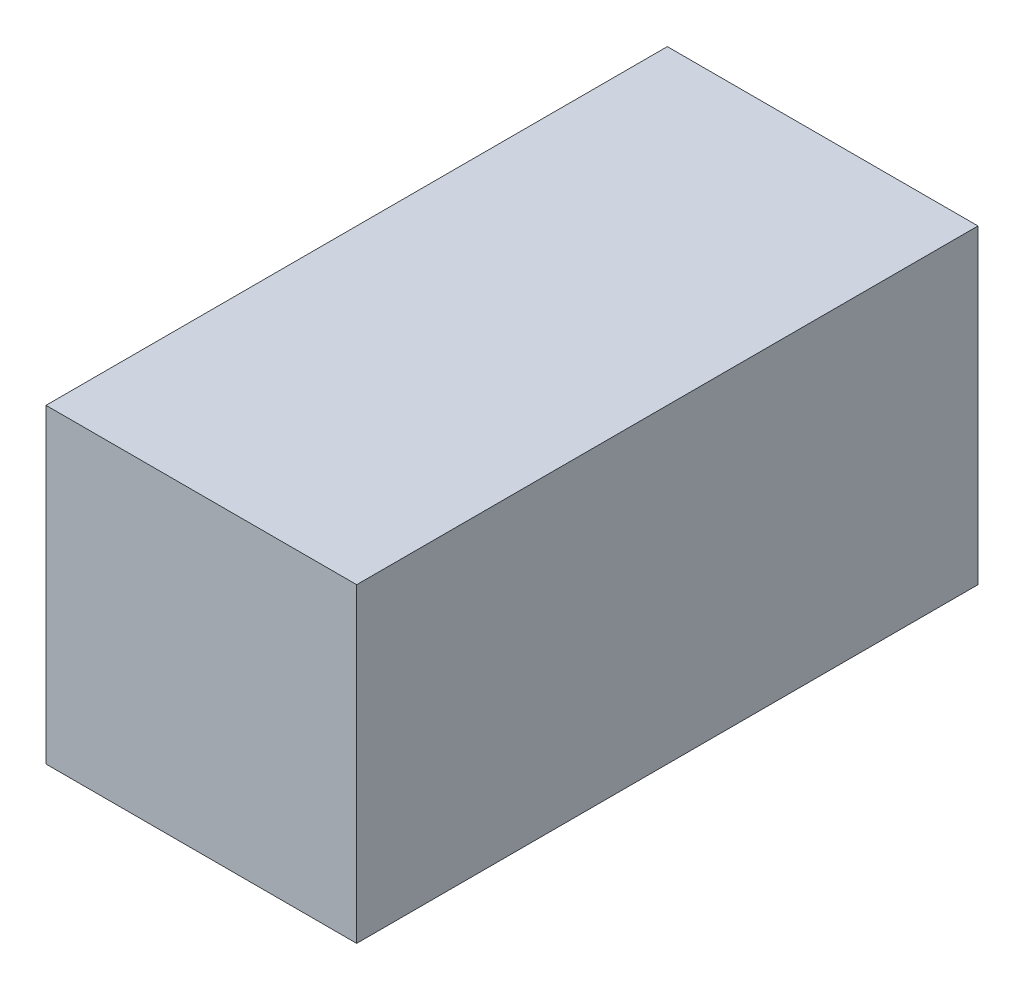
ISO-10303-21;
HEADER;
FILE_DESCRIPTION(('STEP AP214'),'2;1');
FILE_NAME('part.step','',(''),(''),'','','');
FILE_SCHEMA(('AUTOMOTIVE_DESIGN { 1 0 10303 214 1 1 1 1 }'));
ENDSEC;
DATA;
#1=APPLICATION_CONTEXT('core data for automotive mechanical design processes');
#2=APPLICATION_PROTOCOL_DEFINITION('international standard','automotive_design',2000,#1);
#3=PRODUCT_CONTEXT('',#1,'mechanical');
#4=PRODUCT('Part','Part','',(#3));
#5=PRODUCT_RELATED_PRODUCT_CATEGORY('part','',(#4));
#6=PRODUCT_DEFINITION_FORMATION('','',#4);
#7=PRODUCT_DEFINITION_CONTEXT('part definition',#1,'design');
#8=PRODUCT_DEFINITION('design','',#6,#7);
#9=PRODUCT_DEFINITION_SHAPE('','',#8);
#10=(LENGTH_UNIT() NAMED_UNIT(*) SI_UNIT(.MILLI.,.METRE.));
#11=(NAMED_UNIT(*) PLANE_ANGLE_UNIT() SI_UNIT($,.RADIAN.));
#12=(NAMED_UNIT(*) SI_UNIT($,.STERADIAN.) SOLID_ANGLE_UNIT());
#13=UNCERTAINTY_MEASURE_WITH_UNIT(LENGTH_MEASURE(1.E-05),#10,'distance_accuracy_value','');
#14=(GEOMETRIC_REPRESENTATION_CONTEXT(3) GLOBAL_UNCERTAINTY_ASSIGNED_CONTEXT((#13)) GLOBAL_UNIT_ASSIGNED_CONTEXT((#10,
#11,#12)) REPRESENTATION_CONTEXT('',''));
#15=CARTESIAN_POINT('',(0.,0.,0.));
#16=DIRECTION('',(0.,0.,1.));
#17=DIRECTION('',(1.,0.,0.));
#18=AXIS2_PLACEMENT_3D('',#15,#16,#17);
#19=CARTESIAN_POINT('',(0.,0.,20.));
#20=DIRECTION('',(-1.,0.,0.));
#21=DIRECTION('',(0.,0.,1.));
#22=AXIS2_PLACEMENT_3D('',#19,#20,#21);
#23=PLANE('',#22);
#24=DIRECTION('',(0.,1.,0.));
#25=VECTOR('',#24,1.);
#26=CARTESIAN_POINT('',(0.,0.,0.));
#27=LINE('',#26,#25);
#28=CARTESIAN_POINT('',(0.,0.,0.));
#29=VERTEX_POINT('',#28);
#30=CARTESIAN_POINT('',(0.,10.,0.));
#31=VERTEX_POINT('',#30);
#32=EDGE_CURVE('E98',#29,#31,#27,.T.);
#33=ORIENTED_EDGE('',*,*,#32,.T.);
#34=DIRECTION('',(0.,0.,-1.));
#35=VECTOR('',#34,1.);
#36=CARTESIAN_POINT('',(0.,10.,20.));
#37=LINE('',#36,#35);
#38=CARTESIAN_POINT('',(0.,10.,20.));
#39=VERTEX_POINT('',#38);
#40=EDGE_CURVE('E11',#39,#31,#37,.T.);
#41=ORIENTED_EDGE('',*,*,#40,.F.);
#42=DIRECTION('',(0.,1.,0.));
#43=VECTOR('',#42,1.);
#44=CARTESIAN_POINT('',(0.,0.,20.));
#45=LINE('',#44,#43);
#46=CARTESIAN_POINT('',(0.,0.,20.));
#47=VERTEX_POINT('',#46);
#48=EDGE_CURVE('E86',#47,#39,#45,.T.);
#49=ORIENTED_EDGE('',*,*,#48,.F.);
#50=DIRECTION('',(0.,0.,-1.));
#51=VECTOR('',#50,1.);
#52=CARTESIAN_POINT('',(0.,0.,20.));
#53=LINE('',#52,#51);
#54=EDGE_CURVE('E94',#47,#29,#53,.T.);
#55=ORIENTED_EDGE('',*,*,#54,.T.);
#56=EDGE_LOOP('',(#33,#41,#49,#55));
#57=FACE_BOUND('',#56,.T.);
#58=ADVANCED_FACE('F35',(#57),#23,.F.);
#59=CARTESIAN_POINT('',(0.,10.,20.));
#60=DIRECTION('',(0.,-1.,0.));
#61=DIRECTION('',(0.,0.,-1.));
#62=AXIS2_PLACEMENT_3D('',#59,#60,#61);
#63=PLANE('',#62);
#64=DIRECTION('',(-1.,0.,0.));
#65=VECTOR('',#64,1.);
#66=CARTESIAN_POINT('',(0.,10.,0.));
#67=LINE('',#66,#65);
#68=CARTESIAN_POINT('',(-10.,10.,0.));
#69=VERTEX_POINT('',#68);
#70=EDGE_CURVE('E90',#31,#69,#67,.T.);
#71=ORIENTED_EDGE('',*,*,#70,.T.);
#72=DIRECTION('',(0.,0.,-1.));
#73=VECTOR('',#72,1.);
#74=CARTESIAN_POINT('',(-10.,10.,20.));
#75=LINE('',#74,#73);
#76=CARTESIAN_POINT('',(-10.,10.,20.));
#77=VERTEX_POINT('',#76);
#78=EDGE_CURVE('E43',#77,#69,#75,.T.);
#79=ORIENTED_EDGE('',*,*,#78,.F.);
#80=DIRECTION('',(-1.,0.,0.));
#81=VECTOR('',#80,1.);
#82=CARTESIAN_POINT('',(0.,10.,20.));
#83=LINE('',#82,#81);
#84=EDGE_CURVE('E81',#39,#77,#83,.T.);
#85=ORIENTED_EDGE('',*,*,#84,.F.);
#86=ORIENTED_EDGE('',*,*,#40,.T.);
#87=EDGE_LOOP('',(#71,#79,#85,#86));
#88=FACE_BOUND('',#87,.T.);
#89=ADVANCED_FACE('F89',(#88),#63,.F.);
#90=CARTESIAN_POINT('',(-10.,0.,20.));
#91=DIRECTION('',(1.,0.,0.));
#92=DIRECTION('',(0.,0.,-1.));
#93=AXIS2_PLACEMENT_3D('',#90,#91,#92);
#94=PLANE('',#93);
#95=DIRECTION('',(0.,-1.,0.));
#96=VECTOR('',#95,1.);
#97=CARTESIAN_POINT('',(-10.,0.,0.));
#98=LINE('',#97,#96);
#99=CARTESIAN_POINT('',(-10.,0.,0.));
#100=VERTEX_POINT('',#99);
#101=EDGE_CURVE('E68',#69,#100,#98,.T.);
#102=ORIENTED_EDGE('',*,*,#101,.T.);
#103=DIRECTION('',(0.,0.,-1.));
#104=VECTOR('',#103,1.);
#105=CARTESIAN_POINT('',(-10.,0.,20.));
#106=LINE('',#105,#104);
#107=CARTESIAN_POINT('',(-10.,0.,20.));
#108=VERTEX_POINT('',#107);
#109=EDGE_CURVE('E91',#108,#100,#106,.T.);
#110=ORIENTED_EDGE('',*,*,#109,.F.);
#111=DIRECTION('',(0.,-1.,0.));
#112=VECTOR('',#111,1.);
#113=CARTESIAN_POINT('',(-10.,0.,20.));
#114=LINE('',#113,#112);
#115=EDGE_CURVE('E84',#77,#108,#114,.T.);
#116=ORIENTED_EDGE('',*,*,#115,.F.);
#117=ORIENTED_EDGE('',*,*,#78,.T.);
#118=EDGE_LOOP('',(#102,#110,#116,#117));
#119=FACE_BOUND('',#118,.T.);
#120=ADVANCED_FACE('F92',(#119),#94,.F.);
#121=CARTESIAN_POINT('',(0.,0.,20.));
#122=DIRECTION('',(0.,1.,0.));
#123=DIRECTION('',(0.,0.,1.));
#124=AXIS2_PLACEMENT_3D('',#121,#122,#123);
#125=PLANE('',#124);
#126=DIRECTION('',(1.,0.,0.));
#127=VECTOR('',#126,1.);
#128=CARTESIAN_POINT('',(0.,0.,0.));
#129=LINE('',#128,#127);
#130=EDGE_CURVE('E74',#100,#29,#129,.T.);
#131=ORIENTED_EDGE('',*,*,#130,.T.);
#132=ORIENTED_EDGE('',*,*,#54,.F.);
#133=DIRECTION('',(1.,0.,0.));
#134=VECTOR('',#133,1.);
#135=CARTESIAN_POINT('',(0.,0.,20.));
#136=LINE('',#135,#134);
#137=EDGE_CURVE('E51',#108,#47,#136,.T.);
#138=ORIENTED_EDGE('',*,*,#137,.F.);
#139=ORIENTED_EDGE('',*,*,#109,.T.);
#140=EDGE_LOOP('',(#131,#132,#138,#139));
#141=FACE_BOUND('',#140,.T.);
#142=ADVANCED_FACE('F105',(#141),#125,.F.);
#143=CARTESIAN_POINT('',(0.,0.,20.));
#144=DIRECTION('',(0.,0.,1.));
#145=DIRECTION('',(1.,0.,0.));
#146=AXIS2_PLACEMENT_3D('',#143,#144,#145);
#147=PLANE('',#146);
#148=ORIENTED_EDGE('',*,*,#48,.T.);
#149=ORIENTED_EDGE('',*,*,#84,.T.);
#150=ORIENTED_EDGE('',*,*,#115,.T.);
#151=ORIENTED_EDGE('',*,*,#137,.T.);
#152=EDGE_LOOP('',(#148,#149,#150,#151));
#153=FACE_BOUND('',#152,.T.);
#154=ADVANCED_FACE('F82',(#153),#147,.T.);
#155=CARTESIAN_POINT('',(0.,0.,0.));
#156=DIRECTION('',(0.,0.,1.));
#157=DIRECTION('',(1.,0.,0.));
#158=AXIS2_PLACEMENT_3D('',#155,#156,#157);
#159=PLANE('',#158);
#160=ORIENTED_EDGE('',*,*,#32,.F.);
#161=ORIENTED_EDGE('',*,*,#130,.F.);
#162=ORIENTED_EDGE('',*,*,#101,.F.);
#163=ORIENTED_EDGE('',*,*,#70,.F.);
#164=EDGE_LOOP('',(#160,#161,#162,#163));
#165=FACE_BOUND('',#164,.T.);
#166=ADVANCED_FACE('F108',(#165),#159,.F.);
#167=CLOSED_SHELL('',(#58,#89,#120,#142,#154,#166));
#168=MANIFOLD_SOLID_BREP('B2',#167);
#169=ADVANCED_BREP_SHAPE_REPRESENTATION('',(#18,#168),#14);
#170=SHAPE_DEFINITION_REPRESENTATION(#9,#169);
ENDSEC;
END-ISO-10303-21;
